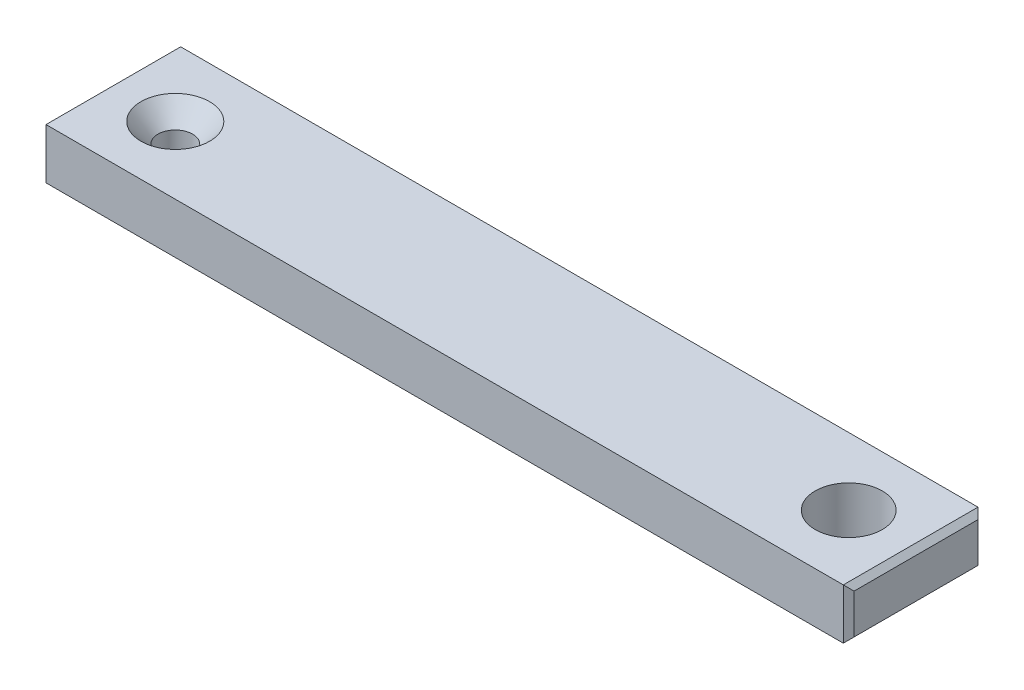
ISO-10303-21;
HEADER;
FILE_DESCRIPTION(('STEP AP214'),'2;1');
FILE_NAME('part.step','',(''),(''),'','','');
FILE_SCHEMA(('AUTOMOTIVE_DESIGN { 1 0 10303 214 1 1 1 1 }'));
ENDSEC;
DATA;
#1=APPLICATION_CONTEXT('core data for automotive mechanical design processes');
#2=APPLICATION_PROTOCOL_DEFINITION('international standard','automotive_design',2000,#1);
#3=PRODUCT_CONTEXT('',#1,'mechanical');
#4=PRODUCT('Part','Part','',(#3));
#5=PRODUCT_RELATED_PRODUCT_CATEGORY('part','',(#4));
#6=PRODUCT_DEFINITION_FORMATION('','',#4);
#7=PRODUCT_DEFINITION_CONTEXT('part definition',#1,'design');
#8=PRODUCT_DEFINITION('design','',#6,#7);
#9=PRODUCT_DEFINITION_SHAPE('','',#8);
#10=(LENGTH_UNIT() NAMED_UNIT(*) SI_UNIT(.MILLI.,.METRE.));
#11=(NAMED_UNIT(*) PLANE_ANGLE_UNIT() SI_UNIT($,.RADIAN.));
#12=(NAMED_UNIT(*) SI_UNIT($,.STERADIAN.) SOLID_ANGLE_UNIT());
#13=UNCERTAINTY_MEASURE_WITH_UNIT(LENGTH_MEASURE(1.E-05),#10,'distance_accuracy_value','');
#14=(GEOMETRIC_REPRESENTATION_CONTEXT(3) GLOBAL_UNCERTAINTY_ASSIGNED_CONTEXT((#13)) GLOBAL_UNIT_ASSIGNED_CONTEXT((#10,
#11,#12)) REPRESENTATION_CONTEXT('',''));
#15=CARTESIAN_POINT('',(0.,0.,0.));
#16=DIRECTION('',(0.,0.,1.));
#17=DIRECTION('',(1.,0.,0.));
#18=AXIS2_PLACEMENT_3D('',#15,#16,#17);
#19=CARTESIAN_POINT('',(0.,4.7625,6.35));
#20=DIRECTION('',(0.,0.,-1.));
#21=DIRECTION('',(-1.,0.,0.));
#22=AXIS2_PLACEMENT_3D('',#19,#20,#21);
#23=PLANE('',#22);
#24=DIRECTION('',(1.,0.,0.));
#25=VECTOR('',#24,1.);
#26=CARTESIAN_POINT('',(0.,4.7625,6.35));
#27=LINE('',#26,#25);
#28=CARTESIAN_POINT('',(-69.342,4.7625,6.35));
#29=VERTEX_POINT('',#28);
#30=CARTESIAN_POINT('',(5.84199999999999,4.7625,6.35));
#31=VERTEX_POINT('',#30);
#32=EDGE_CURVE('E182',#29,#31,#27,.T.);
#33=ORIENTED_EDGE('',*,*,#32,.F.);
#34=DIRECTION('',(0.,-1.,0.));
#35=VECTOR('',#34,1.);
#36=CARTESIAN_POINT('',(-69.342,4.7625,6.35));
#37=LINE('',#36,#35);
#38=CARTESIAN_POINT('',(-69.342,0.,6.35));
#39=VERTEX_POINT('',#38);
#40=EDGE_CURVE('E140',#29,#39,#37,.T.);
#41=ORIENTED_EDGE('',*,*,#40,.T.);
#42=DIRECTION('',(1.,0.,0.));
#43=VECTOR('',#42,1.);
#44=CARTESIAN_POINT('',(0.,0.,6.35));
#45=LINE('',#44,#43);
#46=CARTESIAN_POINT('',(5.84199999999999,0.,6.35));
#47=VERTEX_POINT('',#46);
#48=EDGE_CURVE('E183',#39,#47,#45,.T.);
#49=ORIENTED_EDGE('',*,*,#48,.T.);
#50=DIRECTION('',(0.,1.,0.));
#51=VECTOR('',#50,1.);
#52=CARTESIAN_POINT('',(5.84199999999999,4.7625,6.35));
#53=LINE('',#52,#51);
#54=EDGE_CURVE('E137',#47,#31,#53,.T.);
#55=ORIENTED_EDGE('',*,*,#54,.T.);
#56=EDGE_LOOP('',(#33,#41,#49,#55));
#57=FACE_BOUND('',#56,.T.);
#58=ADVANCED_FACE('F35',(#57),#23,.F.);
#59=CARTESIAN_POINT('',(6.34999999999999,4.7625,0.));
#60=DIRECTION('',(1.,0.,0.));
#61=DIRECTION('',(0.,0.,-1.));
#62=AXIS2_PLACEMENT_3D('',#59,#60,#61);
#63=PLANE('',#62);
#64=DIRECTION('',(0.,0.,1.));
#65=VECTOR('',#64,1.);
#66=CARTESIAN_POINT('',(6.34999999999999,4.25449999999999,0.));
#67=LINE('',#66,#65);
#68=CARTESIAN_POINT('',(6.34999999999999,4.25449999999999,-5.84199999999999));
#69=VERTEX_POINT('',#68);
#70=CARTESIAN_POINT('',(6.34999999999999,4.25449999999999,5.84199999999999));
#71=VERTEX_POINT('',#70);
#72=EDGE_CURVE('E44',#69,#71,#67,.T.);
#73=ORIENTED_EDGE('',*,*,#72,.T.);
#74=DIRECTION('',(0.,-1.,0.));
#75=VECTOR('',#74,1.);
#76=CARTESIAN_POINT('',(6.34999999999999,0.,5.84199999999999));
#77=LINE('',#76,#75);
#78=CARTESIAN_POINT('',(6.34999999999999,0.508000000000008,5.84199999999999));
#79=VERTEX_POINT('',#78);
#80=EDGE_CURVE('E11',#71,#79,#77,.T.);
#81=ORIENTED_EDGE('',*,*,#80,.T.);
#82=DIRECTION('',(0.,0.,-1.));
#83=VECTOR('',#82,1.);
#84=CARTESIAN_POINT('',(6.34999999999999,0.508000000000008,-6.35));
#85=LINE('',#84,#83);
#86=CARTESIAN_POINT('',(6.34999999999999,0.508000000000008,-5.84199999999999));
#87=VERTEX_POINT('',#86);
#88=EDGE_CURVE('E146',#79,#87,#85,.T.);
#89=ORIENTED_EDGE('',*,*,#88,.T.);
#90=DIRECTION('',(0.,1.,0.));
#91=VECTOR('',#90,1.);
#92=CARTESIAN_POINT('',(6.34999999999999,4.7625,-5.84199999999999));
#93=LINE('',#92,#91);
#94=EDGE_CURVE('E55',#87,#69,#93,.T.);
#95=ORIENTED_EDGE('',*,*,#94,.T.);
#96=EDGE_LOOP('',(#73,#81,#89,#95));
#97=FACE_BOUND('',#96,.T.);
#98=ADVANCED_FACE('F240',(#97),#63,.T.);
#99=CARTESIAN_POINT('',(0.,4.7625,-6.35));
#100=DIRECTION('',(0.,0.,-1.));
#101=DIRECTION('',(-1.,0.,0.));
#102=AXIS2_PLACEMENT_3D('',#99,#100,#101);
#103=PLANE('',#102);
#104=DIRECTION('',(1.,0.,0.));
#105=VECTOR('',#104,1.);
#106=CARTESIAN_POINT('',(0.,0.,-6.35));
#107=LINE('',#106,#105);
#108=CARTESIAN_POINT('',(-69.342,0.,-6.35));
#109=VERTEX_POINT('',#108);
#110=CARTESIAN_POINT('',(5.84199999999999,0.,-6.35));
#111=VERTEX_POINT('',#110);
#112=EDGE_CURVE('E176',#109,#111,#107,.T.);
#113=ORIENTED_EDGE('',*,*,#112,.F.);
#114=DIRECTION('',(0.,1.,0.));
#115=VECTOR('',#114,1.);
#116=CARTESIAN_POINT('',(-69.342,4.7625,-6.35));
#117=LINE('',#116,#115);
#118=CARTESIAN_POINT('',(-69.342,4.7625,-6.35));
#119=VERTEX_POINT('',#118);
#120=EDGE_CURVE('E107',#109,#119,#117,.T.);
#121=ORIENTED_EDGE('',*,*,#120,.T.);
#122=DIRECTION('',(1.,0.,0.));
#123=VECTOR('',#122,1.);
#124=CARTESIAN_POINT('',(0.,4.7625,-6.35));
#125=LINE('',#124,#123);
#126=CARTESIAN_POINT('',(5.84199999999999,4.7625,-6.35));
#127=VERTEX_POINT('',#126);
#128=EDGE_CURVE('E120',#119,#127,#125,.T.);
#129=ORIENTED_EDGE('',*,*,#128,.T.);
#130=DIRECTION('',(0.,-1.,0.));
#131=VECTOR('',#130,1.);
#132=CARTESIAN_POINT('',(5.84199999999999,4.7625,-6.35));
#133=LINE('',#132,#131);
#134=EDGE_CURVE('E126',#127,#111,#133,.T.);
#135=ORIENTED_EDGE('',*,*,#134,.T.);
#136=EDGE_LOOP('',(#113,#121,#129,#135));
#137=FACE_BOUND('',#136,.T.);
#138=ADVANCED_FACE('F175',(#137),#103,.T.);
#139=CARTESIAN_POINT('',(-69.85,4.7625,0.));
#140=DIRECTION('',(1.,0.,0.));
#141=DIRECTION('',(0.,0.,-1.));
#142=AXIS2_PLACEMENT_3D('',#139,#140,#141);
#143=PLANE('',#142);
#144=DIRECTION('',(0.,0.,-1.));
#145=VECTOR('',#144,1.);
#146=CARTESIAN_POINT('',(-69.85,4.25450000000001,-6.35));
#147=LINE('',#146,#145);
#148=CARTESIAN_POINT('',(-69.85,4.25450000000001,5.84200000000001));
#149=VERTEX_POINT('',#148);
#150=CARTESIAN_POINT('',(-69.85,4.25450000000001,-5.84200000000001));
#151=VERTEX_POINT('',#150);
#152=EDGE_CURVE('E124',#149,#151,#147,.T.);
#153=ORIENTED_EDGE('',*,*,#152,.T.);
#154=DIRECTION('',(0.,-1.,0.));
#155=VECTOR('',#154,1.);
#156=CARTESIAN_POINT('',(-69.85,0.,-5.84200000000001));
#157=LINE('',#156,#155);
#158=CARTESIAN_POINT('',(-69.85,0.507999999999995,-5.84200000000001));
#159=VERTEX_POINT('',#158);
#160=EDGE_CURVE('E105',#151,#159,#157,.T.);
#161=ORIENTED_EDGE('',*,*,#160,.T.);
#162=DIRECTION('',(0.,0.,1.));
#163=VECTOR('',#162,1.);
#164=CARTESIAN_POINT('',(-69.85,0.507999999999995,0.));
#165=LINE('',#164,#163);
#166=CARTESIAN_POINT('',(-69.85,0.507999999999995,5.84200000000001));
#167=VERTEX_POINT('',#166);
#168=EDGE_CURVE('E113',#159,#167,#165,.T.);
#169=ORIENTED_EDGE('',*,*,#168,.T.);
#170=DIRECTION('',(0.,1.,0.));
#171=VECTOR('',#170,1.);
#172=CARTESIAN_POINT('',(-69.85,4.7625,5.84200000000001));
#173=LINE('',#172,#171);
#174=EDGE_CURVE('E119',#167,#149,#173,.T.);
#175=ORIENTED_EDGE('',*,*,#174,.T.);
#176=EDGE_LOOP('',(#153,#161,#169,#175));
#177=FACE_BOUND('',#176,.T.);
#178=ADVANCED_FACE('F122',(#177),#143,.F.);
#179=CARTESIAN_POINT('',(0.,4.7625,0.));
#180=DIRECTION('',(0.,1.,0.));
#181=DIRECTION('',(0.,0.,1.));
#182=AXIS2_PLACEMENT_3D('',#179,#180,#181);
#183=PLANE('',#182);
#184=CARTESIAN_POINT('',(0.,4.7625,0.));
#185=DIRECTION('',(0.,1.,0.));
#186=DIRECTION('',(0.,0.,1.));
#187=AXIS2_PLACEMENT_3D('',#184,#185,#186);
#188=CIRCLE('',#187,3.1623);
#189=CARTESIAN_POINT('',(0.,4.7625,3.1623));
#190=VERTEX_POINT('',#189);
#191=EDGE_CURVE('E155',#190,#190,#188,.T.);
#192=ORIENTED_EDGE('',*,*,#191,.F.);
#193=EDGE_LOOP('',(#192));
#194=FACE_BOUND('',#193,.T.);
#195=CARTESIAN_POINT('',(-63.5,4.7625,0.));
#196=DIRECTION('',(0.,1.,0.));
#197=DIRECTION('',(0.,0.,1.));
#198=AXIS2_PLACEMENT_3D('',#195,#196,#197);
#199=CIRCLE('',#198,3.2385);
#200=CARTESIAN_POINT('',(-63.5,4.7625,3.2385));
#201=VERTEX_POINT('',#200);
#202=EDGE_CURVE('E206',#201,#201,#199,.T.);
#203=ORIENTED_EDGE('',*,*,#202,.F.);
#204=EDGE_LOOP('',(#203));
#205=FACE_BOUND('',#204,.T.);
#206=ORIENTED_EDGE('',*,*,#128,.F.);
#207=DIRECTION('',(0.,0.,1.));
#208=VECTOR('',#207,1.);
#209=CARTESIAN_POINT('',(-69.342,4.7625,6.35));
#210=LINE('',#209,#208);
#211=EDGE_CURVE('E135',#119,#29,#210,.T.);
#212=ORIENTED_EDGE('',*,*,#211,.T.);
#213=ORIENTED_EDGE('',*,*,#32,.T.);
#214=DIRECTION('',(0.,0.,-1.));
#215=VECTOR('',#214,1.);
#216=CARTESIAN_POINT('',(5.84199999999999,4.7625,0.));
#217=LINE('',#216,#215);
#218=EDGE_CURVE('E133',#31,#127,#217,.T.);
#219=ORIENTED_EDGE('',*,*,#218,.T.);
#220=EDGE_LOOP('',(#206,#212,#213,#219));
#221=FACE_BOUND('',#220,.T.);
#222=ADVANCED_FACE('F199',(#194,#205,#221),#183,.T.);
#223=CARTESIAN_POINT('',(0.,0.,0.));
#224=DIRECTION('',(0.,1.,0.));
#225=DIRECTION('',(0.,0.,1.));
#226=AXIS2_PLACEMENT_3D('',#223,#224,#225);
#227=PLANE('',#226);
#228=CARTESIAN_POINT('',(0.,0.,0.));
#229=DIRECTION('',(0.,1.,0.));
#230=DIRECTION('',(0.,0.,1.));
#231=AXIS2_PLACEMENT_3D('',#228,#229,#230);
#232=CIRCLE('',#231,3.1623);
#233=CARTESIAN_POINT('',(0.,0.,3.1623));
#234=VERTEX_POINT('',#233);
#235=EDGE_CURVE('E209',#234,#234,#232,.T.);
#236=ORIENTED_EDGE('',*,*,#235,.T.);
#237=EDGE_LOOP('',(#236));
#238=FACE_BOUND('',#237,.T.);
#239=CARTESIAN_POINT('',(-63.5,0.,0.));
#240=DIRECTION('',(0.,1.,0.));
#241=DIRECTION('',(0.,0.,1.));
#242=AXIS2_PLACEMENT_3D('',#239,#240,#241);
#243=CIRCLE('',#242,1.63195);
#244=CARTESIAN_POINT('',(-63.5,0.,1.63195));
#245=VERTEX_POINT('',#244);
#246=EDGE_CURVE('E187',#245,#245,#243,.T.);
#247=ORIENTED_EDGE('',*,*,#246,.T.);
#248=EDGE_LOOP('',(#247));
#249=FACE_BOUND('',#248,.T.);
#250=ORIENTED_EDGE('',*,*,#48,.F.);
#251=DIRECTION('',(0.,0.,-1.));
#252=VECTOR('',#251,1.);
#253=CARTESIAN_POINT('',(-69.342,0.,0.));
#254=LINE('',#253,#252);
#255=EDGE_CURVE('E144',#39,#109,#254,.T.);
#256=ORIENTED_EDGE('',*,*,#255,.T.);
#257=ORIENTED_EDGE('',*,*,#112,.T.);
#258=DIRECTION('',(0.,0.,1.));
#259=VECTOR('',#258,1.);
#260=CARTESIAN_POINT('',(5.84199999999999,0.,6.35));
#261=LINE('',#260,#259);
#262=EDGE_CURVE('E142',#111,#47,#261,.T.);
#263=ORIENTED_EDGE('',*,*,#262,.T.);
#264=EDGE_LOOP('',(#250,#256,#257,#263));
#265=FACE_BOUND('',#264,.T.);
#266=ADVANCED_FACE('F180',(#238,#249,#265),#227,.F.);
#267=CARTESIAN_POINT('',(-63.5,4.7625,0.));
#268=DIRECTION('',(0.,1.,0.));
#269=DIRECTION('',(0.,0.,1.));
#270=AXIS2_PLACEMENT_3D('',#267,#268,#269);
#271=CYLINDRICAL_SURFACE('',#270,1.63195);
#272=ORIENTED_EDGE('',*,*,#246,.F.);
#273=EDGE_LOOP('',(#272));
#274=FACE_BOUND('',#273,.T.);
#275=CARTESIAN_POINT('',(-63.5,2.91437563537909,0.));
#276=DIRECTION('',(0.,1.,0.));
#277=DIRECTION('',(0.,0.,1.));
#278=AXIS2_PLACEMENT_3D('',#275,#276,#277);
#279=CIRCLE('',#278,1.63195);
#280=CARTESIAN_POINT('',(-63.5,2.91437563537909,1.63195));
#281=VERTEX_POINT('',#280);
#282=EDGE_CURVE('E203',#281,#281,#279,.T.);
#283=ORIENTED_EDGE('',*,*,#282,.T.);
#284=EDGE_LOOP('',(#283));
#285=FACE_BOUND('',#284,.T.);
#286=ADVANCED_FACE('F230',(#274,#285),#271,.F.);
#287=CARTESIAN_POINT('',(-63.5,4.7625,0.));
#288=DIRECTION('',(0.,1.,0.));
#289=DIRECTION('',(0.,0.,1.));
#290=AXIS2_PLACEMENT_3D('',#287,#288,#289);
#291=CONICAL_SURFACE('',#290,3.2385,0.715584993317675);
#292=ORIENTED_EDGE('',*,*,#282,.F.);
#293=EDGE_LOOP('',(#292));
#294=FACE_BOUND('',#293,.T.);
#295=ORIENTED_EDGE('',*,*,#202,.T.);
#296=EDGE_LOOP('',(#295));
#297=FACE_BOUND('',#296,.T.);
#298=ADVANCED_FACE('F220',(#294,#297),#291,.F.);
#299=CARTESIAN_POINT('',(0.,0.,0.));
#300=DIRECTION('',(0.,1.,0.));
#301=DIRECTION('',(0.,0.,1.));
#302=AXIS2_PLACEMENT_3D('',#299,#300,#301);
#303=CYLINDRICAL_SURFACE('',#302,3.1623);
#304=ORIENTED_EDGE('',*,*,#235,.F.);
#305=EDGE_LOOP('',(#304));
#306=FACE_BOUND('',#305,.T.);
#307=ORIENTED_EDGE('',*,*,#191,.T.);
#308=EDGE_LOOP('',(#307));
#309=FACE_BOUND('',#308,.T.);
#310=ADVANCED_FACE('F217',(#306,#309),#303,.F.);
#311=CARTESIAN_POINT('',(-69.342,4.7625,6.35));
#312=DIRECTION('',(0.707106781186538,0.,-0.707106781186557));
#313=DIRECTION('',(0.,-1.,0.));
#314=AXIS2_PLACEMENT_3D('',#311,#312,#313);
#315=PLANE('',#314);
#316=DIRECTION('',(-0.577350269189631,0.577350269189631,-0.577350269189616));
#317=VECTOR('',#316,1.);
#318=CARTESIAN_POINT('',(-71.7973333333333,2.45533333333331,3.89466666666674));
#319=LINE('',#318,#317);
#320=EDGE_CURVE('E116',#39,#167,#319,.T.);
#321=ORIENTED_EDGE('',*,*,#320,.F.);
#322=ORIENTED_EDGE('',*,*,#40,.F.);
#323=DIRECTION('',(0.577350269189631,0.577350269189631,0.577350269189616));
#324=VECTOR('',#323,1.);
#325=CARTESIAN_POINT('',(-69.342,4.76250000000001,6.35));
#326=LINE('',#325,#324);
#327=EDGE_CURVE('E152',#149,#29,#326,.T.);
#328=ORIENTED_EDGE('',*,*,#327,.F.);
#329=ORIENTED_EDGE('',*,*,#174,.F.);
#330=EDGE_LOOP('',(#321,#322,#328,#329));
#331=FACE_BOUND('',#330,.T.);
#332=ADVANCED_FACE('F193',(#331),#315,.F.);
#333=CARTESIAN_POINT('',(-69.342,4.7625,0.));
#334=DIRECTION('',(-0.707106781186548,0.707106781186548,0.));
#335=DIRECTION('',(0.,0.,-1.));
#336=AXIS2_PLACEMENT_3D('',#333,#334,#335);
#337=PLANE('',#336);
#338=ORIENTED_EDGE('',*,*,#327,.T.);
#339=ORIENTED_EDGE('',*,*,#211,.F.);
#340=DIRECTION('',(-0.577350269189631,-0.577350269189631,0.577350269189616));
#341=VECTOR('',#340,1.);
#342=CARTESIAN_POINT('',(-71.4586666666667,2.64583333333336,-4.2333333333334));
#343=LINE('',#342,#341);
#344=EDGE_CURVE('E110',#151,#119,#343,.F.);
#345=ORIENTED_EDGE('',*,*,#344,.F.);
#346=ORIENTED_EDGE('',*,*,#152,.F.);
#347=EDGE_LOOP('',(#338,#339,#345,#346));
#348=FACE_BOUND('',#347,.T.);
#349=ADVANCED_FACE('F196',(#348),#337,.T.);
#350=CARTESIAN_POINT('',(-69.85,0.507999999999995,0.));
#351=DIRECTION('',(0.707106781186548,0.707106781186548,0.));
#352=DIRECTION('',(0.,0.,1.));
#353=AXIS2_PLACEMENT_3D('',#350,#351,#352);
#354=PLANE('',#353);
#355=ORIENTED_EDGE('',*,*,#320,.T.);
#356=ORIENTED_EDGE('',*,*,#168,.F.);
#357=DIRECTION('',(-0.577350269189631,0.577350269189631,0.577350269189616));
#358=VECTOR('',#357,1.);
#359=CARTESIAN_POINT('',(-71.7973333333333,2.45533333333331,-3.89466666666674));
#360=LINE('',#359,#358);
#361=EDGE_CURVE('E101',#109,#159,#360,.T.);
#362=ORIENTED_EDGE('',*,*,#361,.F.);
#363=ORIENTED_EDGE('',*,*,#255,.F.);
#364=EDGE_LOOP('',(#355,#356,#362,#363));
#365=FACE_BOUND('',#364,.T.);
#366=ADVANCED_FACE('F114',(#365),#354,.F.);
#367=CARTESIAN_POINT('',(-69.85,4.7625,-5.84200000000001));
#368=DIRECTION('',(-0.707106781186538,0.,-0.707106781186557));
#369=DIRECTION('',(0.,1.,0.));
#370=AXIS2_PLACEMENT_3D('',#367,#368,#369);
#371=PLANE('',#370);
#372=ORIENTED_EDGE('',*,*,#344,.T.);
#373=ORIENTED_EDGE('',*,*,#120,.F.);
#374=ORIENTED_EDGE('',*,*,#361,.T.);
#375=ORIENTED_EDGE('',*,*,#160,.F.);
#376=EDGE_LOOP('',(#372,#373,#374,#375));
#377=FACE_BOUND('',#376,.T.);
#378=ADVANCED_FACE('F103',(#377),#371,.T.);
#379=CARTESIAN_POINT('',(5.84199999999999,4.7625,-6.35));
#380=DIRECTION('',(-0.707106781186552,0.,0.707106781186543));
#381=DIRECTION('',(0.,-1.,0.));
#382=AXIS2_PLACEMENT_3D('',#379,#380,#381);
#383=PLANE('',#382);
#384=DIRECTION('',(-0.577350269189621,-0.577350269189628,-0.577350269189628));
#385=VECTOR('',#384,1.);
#386=CARTESIAN_POINT('',(7.95866666666665,2.11666666666669,-4.23333333333331));
#387=LINE('',#386,#385);
#388=EDGE_CURVE('E159',#111,#87,#387,.F.);
#389=ORIENTED_EDGE('',*,*,#388,.F.);
#390=ORIENTED_EDGE('',*,*,#134,.F.);
#391=DIRECTION('',(0.577350269189621,-0.577350269189628,0.577350269189628));
#392=VECTOR('',#391,1.);
#393=CARTESIAN_POINT('',(5.84199999999999,4.7625,-6.35));
#394=LINE('',#393,#392);
#395=EDGE_CURVE('E39',#69,#127,#394,.F.);
#396=ORIENTED_EDGE('',*,*,#395,.F.);
#397=ORIENTED_EDGE('',*,*,#94,.F.);
#398=EDGE_LOOP('',(#389,#390,#396,#397));
#399=FACE_BOUND('',#398,.T.);
#400=ADVANCED_FACE('F37',(#399),#383,.F.);
#401=CARTESIAN_POINT('',(6.34999999999999,4.25449999999999,0.));
#402=DIRECTION('',(-0.707106781186552,-0.707106781186543,0.));
#403=DIRECTION('',(0.,0.,1.));
#404=AXIS2_PLACEMENT_3D('',#401,#402,#403);
#405=PLANE('',#404);
#406=ORIENTED_EDGE('',*,*,#395,.T.);
#407=ORIENTED_EDGE('',*,*,#218,.F.);
#408=DIRECTION('',(-0.577350269189621,0.577350269189628,0.577350269189628));
#409=VECTOR('',#408,1.);
#410=CARTESIAN_POINT('',(8.29733333333332,2.30716666666664,3.89466666666664));
#411=LINE('',#410,#409);
#412=EDGE_CURVE('E158',#71,#31,#411,.T.);
#413=ORIENTED_EDGE('',*,*,#412,.F.);
#414=ORIENTED_EDGE('',*,*,#72,.F.);
#415=EDGE_LOOP('',(#406,#407,#413,#414));
#416=FACE_BOUND('',#415,.T.);
#417=ADVANCED_FACE('F168',(#416),#405,.F.);
#418=CARTESIAN_POINT('',(5.84199999999999,0.,0.));
#419=DIRECTION('',(0.707106781186552,-0.707106781186543,0.));
#420=DIRECTION('',(0.,0.,-1.));
#421=AXIS2_PLACEMENT_3D('',#418,#419,#420);
#422=PLANE('',#421);
#423=ORIENTED_EDGE('',*,*,#388,.T.);
#424=ORIENTED_EDGE('',*,*,#88,.F.);
#425=DIRECTION('',(-0.577350269189621,-0.577350269189628,0.577350269189628));
#426=VECTOR('',#425,1.);
#427=CARTESIAN_POINT('',(7.95866666666665,2.11666666666669,4.23333333333331));
#428=LINE('',#427,#426);
#429=EDGE_CURVE('E156',#47,#79,#428,.F.);
#430=ORIENTED_EDGE('',*,*,#429,.F.);
#431=ORIENTED_EDGE('',*,*,#262,.F.);
#432=EDGE_LOOP('',(#423,#424,#430,#431));
#433=FACE_BOUND('',#432,.T.);
#434=ADVANCED_FACE('F260',(#433),#422,.T.);
#435=CARTESIAN_POINT('',(6.34999999999999,4.7625,5.84199999999999));
#436=DIRECTION('',(0.707106781186552,0.,0.707106781186543));
#437=DIRECTION('',(0.,1.,0.));
#438=AXIS2_PLACEMENT_3D('',#435,#436,#437);
#439=PLANE('',#438);
#440=ORIENTED_EDGE('',*,*,#412,.T.);
#441=ORIENTED_EDGE('',*,*,#54,.F.);
#442=ORIENTED_EDGE('',*,*,#429,.T.);
#443=ORIENTED_EDGE('',*,*,#80,.F.);
#444=EDGE_LOOP('',(#440,#441,#442,#443));
#445=FACE_BOUND('',#444,.T.);
#446=ADVANCED_FACE('F257',(#445),#439,.T.);
#447=CLOSED_SHELL('',(#58,#98,#138,#178,#222,#266,#286,#298,#310,#332,#349,#366,#378,#400,#417,
#434,#446));
#448=MANIFOLD_SOLID_BREP('B2',#447);
#449=ADVANCED_BREP_SHAPE_REPRESENTATION('',(#18,#448),#14);
#450=SHAPE_DEFINITION_REPRESENTATION(#9,#449);
ENDSEC;
END-ISO-10303-21;
